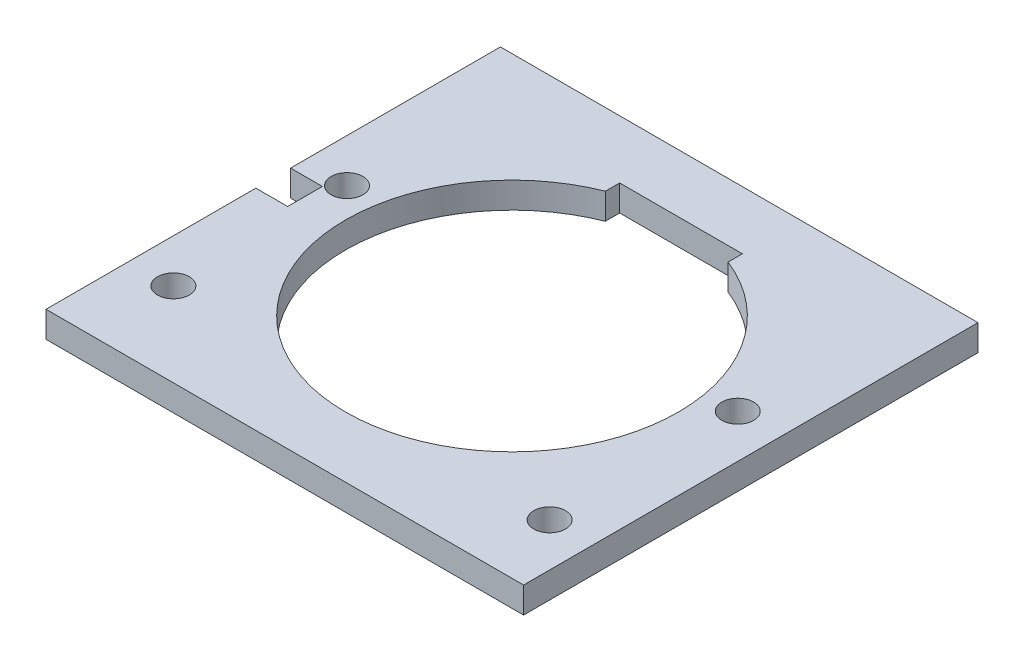
ISO-10303-21;
HEADER;
FILE_DESCRIPTION(('STEP AP214'),'2;1');
FILE_NAME('part.step','',(''),(''),'','','');
FILE_SCHEMA(('AUTOMOTIVE_DESIGN { 1 0 10303 214 1 1 1 1 }'));
ENDSEC;
DATA;
#1=APPLICATION_CONTEXT('core data for automotive mechanical design processes');
#2=APPLICATION_PROTOCOL_DEFINITION('international standard','automotive_design',2000,#1);
#3=PRODUCT_CONTEXT('',#1,'mechanical');
#4=PRODUCT('Part','Part','',(#3));
#5=PRODUCT_RELATED_PRODUCT_CATEGORY('part','',(#4));
#6=PRODUCT_DEFINITION_FORMATION('','',#4);
#7=PRODUCT_DEFINITION_CONTEXT('part definition',#1,'design');
#8=PRODUCT_DEFINITION('design','',#6,#7);
#9=PRODUCT_DEFINITION_SHAPE('','',#8);
#10=(LENGTH_UNIT() NAMED_UNIT(*) SI_UNIT(.MILLI.,.METRE.));
#11=(NAMED_UNIT(*) PLANE_ANGLE_UNIT() SI_UNIT($,.RADIAN.));
#12=(NAMED_UNIT(*) SI_UNIT($,.STERADIAN.) SOLID_ANGLE_UNIT());
#13=UNCERTAINTY_MEASURE_WITH_UNIT(LENGTH_MEASURE(1.E-05),#10,'distance_accuracy_value','');
#14=(GEOMETRIC_REPRESENTATION_CONTEXT(3) GLOBAL_UNCERTAINTY_ASSIGNED_CONTEXT((#13)) GLOBAL_UNIT_ASSIGNED_CONTEXT((#10,
#11,#12)) REPRESENTATION_CONTEXT('',''));
#15=CARTESIAN_POINT('',(0.,0.,0.));
#16=DIRECTION('',(0.,0.,1.));
#17=DIRECTION('',(1.,0.,0.));
#18=AXIS2_PLACEMENT_3D('',#15,#16,#17);
#19=CARTESIAN_POINT('',(-41.91,2.286,0.));
#20=DIRECTION('',(1.,0.,0.));
#21=DIRECTION('',(0.,0.,-1.));
#22=AXIS2_PLACEMENT_3D('',#19,#20,#21);
#23=PLANE('',#22);
#24=DIRECTION('',(0.,0.,1.));
#25=VECTOR('',#24,1.);
#26=CARTESIAN_POINT('',(-41.91,2.286,0.));
#27=LINE('',#26,#25);
#28=CARTESIAN_POINT('',(-41.91,2.286,21.463));
#29=VERTEX_POINT('',#28);
#30=CARTESIAN_POINT('',(-41.91,2.286,39.878));
#31=VERTEX_POINT('',#30);
#32=EDGE_CURVE('E190',#29,#31,#27,.T.);
#33=ORIENTED_EDGE('',*,*,#32,.F.);
#34=DIRECTION('',(0.,-1.,0.));
#35=VECTOR('',#34,1.);
#36=CARTESIAN_POINT('',(-41.91,2.286,21.463));
#37=LINE('',#36,#35);
#38=CARTESIAN_POINT('',(-41.91,0.,21.463));
#39=VERTEX_POINT('',#38);
#40=EDGE_CURVE('E147',#29,#39,#37,.T.);
#41=ORIENTED_EDGE('',*,*,#40,.T.);
#42=DIRECTION('',(0.,0.,1.));
#43=VECTOR('',#42,1.);
#44=CARTESIAN_POINT('',(-41.91,0.,0.));
#45=LINE('',#44,#43);
#46=CARTESIAN_POINT('',(-41.91,0.,39.878));
#47=VERTEX_POINT('',#46);
#48=EDGE_CURVE('E201',#39,#47,#45,.T.);
#49=ORIENTED_EDGE('',*,*,#48,.T.);
#50=DIRECTION('',(0.,-1.,0.));
#51=VECTOR('',#50,1.);
#52=CARTESIAN_POINT('',(-41.91,2.286,39.878));
#53=LINE('',#52,#51);
#54=EDGE_CURVE('E208',#31,#47,#53,.T.);
#55=ORIENTED_EDGE('',*,*,#54,.F.);
#56=EDGE_LOOP('',(#33,#41,#49,#55));
#57=FACE_BOUND('',#56,.T.);
#58=ADVANCED_FACE('F31',(#57),#23,.F.);
#59=CARTESIAN_POINT('',(0.,2.286,0.));
#60=DIRECTION('',(0.,1.,0.));
#61=DIRECTION('',(0.,0.,1.));
#62=AXIS2_PLACEMENT_3D('',#59,#60,#61);
#63=PLANE('',#62);
#64=CARTESIAN_POINT('',(-20.955,2.286,19.939));
#65=DIRECTION('',(0.,-1.,0.));
#66=DIRECTION('',(0.,0.,-1.));
#67=AXIS2_PLACEMENT_3D('',#64,#65,#66);
#68=CIRCLE('',#67,14.605);
#69=CARTESIAN_POINT('',(-15.5702,2.286,6.36291978662471));
#70=VERTEX_POINT('',#69);
#71=CARTESIAN_POINT('',(-26.3398,2.286,6.36291978662472));
#72=VERTEX_POINT('',#71);
#73=EDGE_CURVE('E120',#70,#72,#68,.T.);
#74=ORIENTED_EDGE('',*,*,#73,.T.);
#75=DIRECTION('',(0.,0.,1.));
#76=VECTOR('',#75,1.);
#77=CARTESIAN_POINT('',(-26.3398,2.286,25.273));
#78=LINE('',#77,#76);
#79=CARTESIAN_POINT('',(-26.3398,2.286,5.10540000000001));
#80=VERTEX_POINT('',#79);
#81=EDGE_CURVE('E140',#80,#72,#78,.T.);
#82=ORIENTED_EDGE('',*,*,#81,.F.);
#83=DIRECTION('',(-1.,0.,0.));
#84=VECTOR('',#83,1.);
#85=CARTESIAN_POINT('',(-26.3398,2.286,5.10540000000001));
#86=LINE('',#85,#84);
#87=CARTESIAN_POINT('',(-15.5702,2.286,5.10540000000001));
#88=VERTEX_POINT('',#87);
#89=EDGE_CURVE('E144',#88,#80,#86,.T.);
#90=ORIENTED_EDGE('',*,*,#89,.F.);
#91=DIRECTION('',(0.,0.,-1.));
#92=VECTOR('',#91,1.);
#93=CARTESIAN_POINT('',(-15.5702,2.286,25.273));
#94=LINE('',#93,#92);
#95=EDGE_CURVE('E151',#70,#88,#94,.T.);
#96=ORIENTED_EDGE('',*,*,#95,.F.);
#97=EDGE_LOOP('',(#74,#82,#90,#96));
#98=FACE_BOUND('',#97,.T.);
#99=DIRECTION('',(-1.,0.,0.));
#100=VECTOR('',#99,1.);
#101=CARTESIAN_POINT('',(-41.91,2.286,21.463));
#102=LINE('',#101,#100);
#103=CARTESIAN_POINT('',(-39.116,2.286,21.463));
#104=VERTEX_POINT('',#103);
#105=EDGE_CURVE('E258',#104,#29,#102,.T.);
#106=ORIENTED_EDGE('',*,*,#105,.T.);
#107=ORIENTED_EDGE('',*,*,#32,.T.);
#108=DIRECTION('',(1.,0.,0.));
#109=VECTOR('',#108,1.);
#110=CARTESIAN_POINT('',(-41.91,2.286,39.878));
#111=LINE('',#110,#109);
#112=CARTESIAN_POINT('',(0.,2.286,39.878));
#113=VERTEX_POINT('',#112);
#114=EDGE_CURVE('E194',#31,#113,#111,.T.);
#115=ORIENTED_EDGE('',*,*,#114,.T.);
#116=DIRECTION('',(0.,0.,-1.));
#117=VECTOR('',#116,1.);
#118=CARTESIAN_POINT('',(0.,2.286,39.878));
#119=LINE('',#118,#117);
#120=CARTESIAN_POINT('',(0.,2.286,0.));
#121=VERTEX_POINT('',#120);
#122=EDGE_CURVE('E184',#113,#121,#119,.T.);
#123=ORIENTED_EDGE('',*,*,#122,.T.);
#124=DIRECTION('',(-1.,0.,0.));
#125=VECTOR('',#124,1.);
#126=CARTESIAN_POINT('',(0.,2.286,0.));
#127=LINE('',#126,#125);
#128=CARTESIAN_POINT('',(-41.91,2.286,0.));
#129=VERTEX_POINT('',#128);
#130=EDGE_CURVE('E187',#121,#129,#127,.T.);
#131=ORIENTED_EDGE('',*,*,#130,.T.);
#132=CARTESIAN_POINT('',(-41.91,2.286,18.415));
#133=VERTEX_POINT('',#132);
#134=EDGE_CURVE('E191',#129,#133,#27,.T.);
#135=ORIENTED_EDGE('',*,*,#134,.T.);
#136=DIRECTION('',(1.,0.,0.));
#137=VECTOR('',#136,1.);
#138=CARTESIAN_POINT('',(-41.91,2.286,18.415));
#139=LINE('',#138,#137);
#140=CARTESIAN_POINT('',(-39.116,2.286,18.415));
#141=VERTEX_POINT('',#140);
#142=EDGE_CURVE('E53',#133,#141,#139,.T.);
#143=ORIENTED_EDGE('',*,*,#142,.T.);
#144=DIRECTION('',(0.,0.,1.));
#145=VECTOR('',#144,1.);
#146=CARTESIAN_POINT('',(-39.116,2.286,18.415));
#147=LINE('',#146,#145);
#148=EDGE_CURVE('E254',#141,#104,#147,.T.);
#149=ORIENTED_EDGE('',*,*,#148,.T.);
#150=EDGE_LOOP('',(#106,#107,#115,#123,#131,#135,#143,#149));
#151=FACE_BOUND('',#150,.T.);
#152=CARTESIAN_POINT('',(-3.81000000000001,2.286,33.782));
#153=DIRECTION('',(0.,1.,0.));
#154=DIRECTION('',(0.,0.,-1.));
#155=AXIS2_PLACEMENT_3D('',#152,#153,#154);
#156=CIRCLE('',#155,1.39700000000001);
#157=CARTESIAN_POINT('',(-3.81000000000001,2.286,32.385));
#158=VERTEX_POINT('',#157);
#159=EDGE_CURVE('E166',#158,#158,#156,.T.);
#160=ORIENTED_EDGE('',*,*,#159,.F.);
#161=EDGE_LOOP('',(#160));
#162=FACE_BOUND('',#161,.T.);
#163=CARTESIAN_POINT('',(-38.1,2.286,17.272));
#164=DIRECTION('',(0.,1.,0.));
#165=DIRECTION('',(0.,0.,1.));
#166=AXIS2_PLACEMENT_3D('',#163,#164,#165);
#167=CIRCLE('',#166,1.39700000000001);
#168=CARTESIAN_POINT('',(-38.1,2.286,18.669));
#169=VERTEX_POINT('',#168);
#170=EDGE_CURVE('E178',#169,#169,#167,.T.);
#171=ORIENTED_EDGE('',*,*,#170,.F.);
#172=EDGE_LOOP('',(#171));
#173=FACE_BOUND('',#172,.T.);
#174=CARTESIAN_POINT('',(-38.1,2.286,32.512));
#175=DIRECTION('',(0.,1.,0.));
#176=DIRECTION('',(0.,0.,1.));
#177=AXIS2_PLACEMENT_3D('',#174,#175,#176);
#178=CIRCLE('',#177,1.39700000000001);
#179=CARTESIAN_POINT('',(-38.1,2.286,33.909));
#180=VERTEX_POINT('',#179);
#181=EDGE_CURVE('E172',#180,#180,#178,.T.);
#182=ORIENTED_EDGE('',*,*,#181,.F.);
#183=EDGE_LOOP('',(#182));
#184=FACE_BOUND('',#183,.T.);
#185=CARTESIAN_POINT('',(-3.81000000000001,2.286,17.272));
#186=DIRECTION('',(0.,1.,0.));
#187=DIRECTION('',(0.,0.,-1.));
#188=AXIS2_PLACEMENT_3D('',#185,#186,#187);
#189=CIRCLE('',#188,1.39700000000001);
#190=CARTESIAN_POINT('',(-3.81000000000001,2.286,15.875));
#191=VERTEX_POINT('',#190);
#192=EDGE_CURVE('E160',#191,#191,#189,.T.);
#193=ORIENTED_EDGE('',*,*,#192,.F.);
#194=EDGE_LOOP('',(#193));
#195=FACE_BOUND('',#194,.T.);
#196=ADVANCED_FACE('F237',(#98,#151,#162,#173,#184,#195),#63,.T.);
#197=CARTESIAN_POINT('',(0.,0.,0.));
#198=DIRECTION('',(0.,1.,0.));
#199=DIRECTION('',(0.,0.,1.));
#200=AXIS2_PLACEMENT_3D('',#197,#198,#199);
#201=PLANE('',#200);
#202=DIRECTION('',(0.,0.,1.));
#203=VECTOR('',#202,1.);
#204=CARTESIAN_POINT('',(-26.3398,0.,25.273));
#205=LINE('',#204,#203);
#206=CARTESIAN_POINT('',(-26.3398,0.,5.10540000000001));
#207=VERTEX_POINT('',#206);
#208=CARTESIAN_POINT('',(-26.3398,0.,6.36291978662472));
#209=VERTEX_POINT('',#208);
#210=EDGE_CURVE('E133',#207,#209,#205,.T.);
#211=ORIENTED_EDGE('',*,*,#210,.T.);
#212=CARTESIAN_POINT('',(-20.955,0.,19.939));
#213=DIRECTION('',(0.,-1.,0.));
#214=DIRECTION('',(0.,0.,-1.));
#215=AXIS2_PLACEMENT_3D('',#212,#213,#214);
#216=CIRCLE('',#215,14.605);
#217=CARTESIAN_POINT('',(-15.5702,0.,6.36291978662471));
#218=VERTEX_POINT('',#217);
#219=EDGE_CURVE('E46',#218,#209,#216,.T.);
#220=ORIENTED_EDGE('',*,*,#219,.F.);
#221=DIRECTION('',(0.,0.,-1.));
#222=VECTOR('',#221,1.);
#223=CARTESIAN_POINT('',(-15.5702,0.,25.273));
#224=LINE('',#223,#222);
#225=CARTESIAN_POINT('',(-15.5702,0.,5.10540000000001));
#226=VERTEX_POINT('',#225);
#227=EDGE_CURVE('E131',#218,#226,#224,.T.);
#228=ORIENTED_EDGE('',*,*,#227,.T.);
#229=DIRECTION('',(-1.,0.,0.));
#230=VECTOR('',#229,1.);
#231=CARTESIAN_POINT('',(-26.3398,0.,5.10540000000001));
#232=LINE('',#231,#230);
#233=EDGE_CURVE('E139',#226,#207,#232,.T.);
#234=ORIENTED_EDGE('',*,*,#233,.T.);
#235=EDGE_LOOP('',(#211,#220,#228,#234));
#236=FACE_BOUND('',#235,.T.);
#237=CARTESIAN_POINT('',(-3.81000000000001,0.,33.782));
#238=DIRECTION('',(0.,1.,0.));
#239=DIRECTION('',(0.,0.,-1.));
#240=AXIS2_PLACEMENT_3D('',#237,#238,#239);
#241=CIRCLE('',#240,1.39700000000001);
#242=CARTESIAN_POINT('',(-3.81000000000001,0.,32.385));
#243=VERTEX_POINT('',#242);
#244=EDGE_CURVE('E163',#243,#243,#241,.T.);
#245=ORIENTED_EDGE('',*,*,#244,.T.);
#246=EDGE_LOOP('',(#245));
#247=FACE_BOUND('',#246,.T.);
#248=CARTESIAN_POINT('',(-38.1,0.,17.272));
#249=DIRECTION('',(0.,1.,0.));
#250=DIRECTION('',(0.,0.,1.));
#251=AXIS2_PLACEMENT_3D('',#248,#249,#250);
#252=CIRCLE('',#251,1.39700000000001);
#253=CARTESIAN_POINT('',(-38.1,0.,18.669));
#254=VERTEX_POINT('',#253);
#255=EDGE_CURVE('E175',#254,#254,#252,.T.);
#256=ORIENTED_EDGE('',*,*,#255,.T.);
#257=EDGE_LOOP('',(#256));
#258=FACE_BOUND('',#257,.T.);
#259=ORIENTED_EDGE('',*,*,#48,.F.);
#260=DIRECTION('',(-1.,0.,0.));
#261=VECTOR('',#260,1.);
#262=CARTESIAN_POINT('',(-41.91,0.,21.463));
#263=LINE('',#262,#261);
#264=CARTESIAN_POINT('',(-39.116,0.,21.463));
#265=VERTEX_POINT('',#264);
#266=EDGE_CURVE('E124',#265,#39,#263,.T.);
#267=ORIENTED_EDGE('',*,*,#266,.F.);
#268=DIRECTION('',(0.,0.,1.));
#269=VECTOR('',#268,1.);
#270=CARTESIAN_POINT('',(-39.116,0.,18.415));
#271=LINE('',#270,#269);
#272=CARTESIAN_POINT('',(-39.116,0.,18.415));
#273=VERTEX_POINT('',#272);
#274=EDGE_CURVE('E249',#273,#265,#271,.T.);
#275=ORIENTED_EDGE('',*,*,#274,.F.);
#276=DIRECTION('',(1.,0.,0.));
#277=VECTOR('',#276,1.);
#278=CARTESIAN_POINT('',(-41.91,0.,18.415));
#279=LINE('',#278,#277);
#280=CARTESIAN_POINT('',(-41.91,0.,18.415));
#281=VERTEX_POINT('',#280);
#282=EDGE_CURVE('E230',#281,#273,#279,.T.);
#283=ORIENTED_EDGE('',*,*,#282,.F.);
#284=CARTESIAN_POINT('',(-41.91,0.,0.));
#285=VERTEX_POINT('',#284);
#286=EDGE_CURVE('E202',#285,#281,#45,.T.);
#287=ORIENTED_EDGE('',*,*,#286,.F.);
#288=DIRECTION('',(-1.,0.,0.));
#289=VECTOR('',#288,1.);
#290=CARTESIAN_POINT('',(0.,0.,0.));
#291=LINE('',#290,#289);
#292=CARTESIAN_POINT('',(0.,0.,0.));
#293=VERTEX_POINT('',#292);
#294=EDGE_CURVE('E199',#293,#285,#291,.T.);
#295=ORIENTED_EDGE('',*,*,#294,.F.);
#296=DIRECTION('',(0.,0.,-1.));
#297=VECTOR('',#296,1.);
#298=CARTESIAN_POINT('',(0.,0.,39.878));
#299=LINE('',#298,#297);
#300=CARTESIAN_POINT('',(0.,0.,39.878));
#301=VERTEX_POINT('',#300);
#302=EDGE_CURVE('E181',#301,#293,#299,.T.);
#303=ORIENTED_EDGE('',*,*,#302,.F.);
#304=DIRECTION('',(1.,0.,0.));
#305=VECTOR('',#304,1.);
#306=CARTESIAN_POINT('',(-41.91,0.,39.878));
#307=LINE('',#306,#305);
#308=EDGE_CURVE('E188',#47,#301,#307,.T.);
#309=ORIENTED_EDGE('',*,*,#308,.F.);
#310=EDGE_LOOP('',(#259,#267,#275,#283,#287,#295,#303,#309));
#311=FACE_BOUND('',#310,.T.);
#312=CARTESIAN_POINT('',(-38.1,0.,32.512));
#313=DIRECTION('',(0.,1.,0.));
#314=DIRECTION('',(0.,0.,1.));
#315=AXIS2_PLACEMENT_3D('',#312,#313,#314);
#316=CIRCLE('',#315,1.39700000000001);
#317=CARTESIAN_POINT('',(-38.1,0.,33.909));
#318=VERTEX_POINT('',#317);
#319=EDGE_CURVE('E169',#318,#318,#316,.T.);
#320=ORIENTED_EDGE('',*,*,#319,.T.);
#321=EDGE_LOOP('',(#320));
#322=FACE_BOUND('',#321,.T.);
#323=CARTESIAN_POINT('',(-3.81000000000001,0.,17.272));
#324=DIRECTION('',(0.,1.,0.));
#325=DIRECTION('',(0.,0.,-1.));
#326=AXIS2_PLACEMENT_3D('',#323,#324,#325);
#327=CIRCLE('',#326,1.39700000000001);
#328=CARTESIAN_POINT('',(-3.81000000000001,0.,15.875));
#329=VERTEX_POINT('',#328);
#330=EDGE_CURVE('E158',#329,#329,#327,.T.);
#331=ORIENTED_EDGE('',*,*,#330,.T.);
#332=EDGE_LOOP('',(#331));
#333=FACE_BOUND('',#332,.T.);
#334=ADVANCED_FACE('F128',(#236,#247,#258,#311,#322,#333),#201,.F.);
#335=CARTESIAN_POINT('',(0.,2.286,39.878));
#336=DIRECTION('',(-1.,0.,0.));
#337=DIRECTION('',(0.,0.,1.));
#338=AXIS2_PLACEMENT_3D('',#335,#336,#337);
#339=PLANE('',#338);
#340=ORIENTED_EDGE('',*,*,#302,.T.);
#341=DIRECTION('',(0.,-1.,0.));
#342=VECTOR('',#341,1.);
#343=CARTESIAN_POINT('',(0.,2.286,0.));
#344=LINE('',#343,#342);
#345=EDGE_CURVE('E39',#121,#293,#344,.T.);
#346=ORIENTED_EDGE('',*,*,#345,.F.);
#347=ORIENTED_EDGE('',*,*,#122,.F.);
#348=DIRECTION('',(0.,-1.,0.));
#349=VECTOR('',#348,1.);
#350=CARTESIAN_POINT('',(0.,2.286,39.878));
#351=LINE('',#350,#349);
#352=EDGE_CURVE('E196',#113,#301,#351,.T.);
#353=ORIENTED_EDGE('',*,*,#352,.T.);
#354=EDGE_LOOP('',(#340,#346,#347,#353));
#355=FACE_BOUND('',#354,.T.);
#356=ADVANCED_FACE('F33',(#355),#339,.F.);
#357=CARTESIAN_POINT('',(0.,2.286,0.));
#358=DIRECTION('',(0.,0.,1.));
#359=DIRECTION('',(1.,0.,0.));
#360=AXIS2_PLACEMENT_3D('',#357,#358,#359);
#361=PLANE('',#360);
#362=ORIENTED_EDGE('',*,*,#294,.T.);
#363=DIRECTION('',(0.,-1.,0.));
#364=VECTOR('',#363,1.);
#365=CARTESIAN_POINT('',(-41.91,2.286,0.));
#366=LINE('',#365,#364);
#367=EDGE_CURVE('E211',#129,#285,#366,.T.);
#368=ORIENTED_EDGE('',*,*,#367,.F.);
#369=ORIENTED_EDGE('',*,*,#130,.F.);
#370=ORIENTED_EDGE('',*,*,#345,.T.);
#371=EDGE_LOOP('',(#362,#368,#369,#370));
#372=FACE_BOUND('',#371,.T.);
#373=ADVANCED_FACE('F216',(#372),#361,.F.);
#374=ORIENTED_EDGE('',*,*,#286,.T.);
#375=DIRECTION('',(0.,-1.,0.));
#376=VECTOR('',#375,1.);
#377=CARTESIAN_POINT('',(-41.91,2.286,18.415));
#378=LINE('',#377,#376);
#379=EDGE_CURVE('E234',#133,#281,#378,.T.);
#380=ORIENTED_EDGE('',*,*,#379,.F.);
#381=ORIENTED_EDGE('',*,*,#134,.F.);
#382=ORIENTED_EDGE('',*,*,#367,.T.);
#383=EDGE_LOOP('',(#374,#380,#381,#382));
#384=FACE_BOUND('',#383,.T.);
#385=ADVANCED_FACE('F232',(#384),#23,.F.);
#386=CARTESIAN_POINT('',(-41.91,2.286,39.878));
#387=DIRECTION('',(0.,0.,-1.));
#388=DIRECTION('',(-1.,0.,0.));
#389=AXIS2_PLACEMENT_3D('',#386,#387,#388);
#390=PLANE('',#389);
#391=ORIENTED_EDGE('',*,*,#308,.T.);
#392=ORIENTED_EDGE('',*,*,#352,.F.);
#393=ORIENTED_EDGE('',*,*,#114,.F.);
#394=ORIENTED_EDGE('',*,*,#54,.T.);
#395=EDGE_LOOP('',(#391,#392,#393,#394));
#396=FACE_BOUND('',#395,.T.);
#397=ADVANCED_FACE('F244',(#396),#390,.F.);
#398=CARTESIAN_POINT('',(-38.1,2.286,17.272));
#399=DIRECTION('',(0.,-1.,0.));
#400=DIRECTION('',(0.,0.,-1.));
#401=AXIS2_PLACEMENT_3D('',#398,#399,#400);
#402=CYLINDRICAL_SURFACE('',#401,1.39700000000001);
#403=ORIENTED_EDGE('',*,*,#170,.T.);
#404=EDGE_LOOP('',(#403));
#405=FACE_BOUND('',#404,.T.);
#406=ORIENTED_EDGE('',*,*,#255,.F.);
#407=EDGE_LOOP('',(#406));
#408=FACE_BOUND('',#407,.T.);
#409=ADVANCED_FACE('F295',(#405,#408),#402,.F.);
#410=CARTESIAN_POINT('',(-38.1,2.286,32.512));
#411=DIRECTION('',(0.,-1.,0.));
#412=DIRECTION('',(0.,0.,-1.));
#413=AXIS2_PLACEMENT_3D('',#410,#411,#412);
#414=CYLINDRICAL_SURFACE('',#413,1.39700000000001);
#415=ORIENTED_EDGE('',*,*,#181,.T.);
#416=EDGE_LOOP('',(#415));
#417=FACE_BOUND('',#416,.T.);
#418=ORIENTED_EDGE('',*,*,#319,.F.);
#419=EDGE_LOOP('',(#418));
#420=FACE_BOUND('',#419,.T.);
#421=ADVANCED_FACE('F308',(#417,#420),#414,.F.);
#422=CARTESIAN_POINT('',(-3.81000000000001,2.286,33.782));
#423=DIRECTION('',(0.,-1.,0.));
#424=DIRECTION('',(0.,0.,-1.));
#425=AXIS2_PLACEMENT_3D('',#422,#423,#424);
#426=CYLINDRICAL_SURFACE('',#425,1.39700000000001);
#427=ORIENTED_EDGE('',*,*,#159,.T.);
#428=EDGE_LOOP('',(#427));
#429=FACE_BOUND('',#428,.T.);
#430=ORIENTED_EDGE('',*,*,#244,.F.);
#431=EDGE_LOOP('',(#430));
#432=FACE_BOUND('',#431,.T.);
#433=ADVANCED_FACE('F312',(#429,#432),#426,.F.);
#434=CARTESIAN_POINT('',(-3.81000000000001,2.286,17.272));
#435=DIRECTION('',(0.,-1.,0.));
#436=DIRECTION('',(0.,0.,-1.));
#437=AXIS2_PLACEMENT_3D('',#434,#435,#436);
#438=CYLINDRICAL_SURFACE('',#437,1.39700000000001);
#439=ORIENTED_EDGE('',*,*,#192,.T.);
#440=EDGE_LOOP('',(#439));
#441=FACE_BOUND('',#440,.T.);
#442=ORIENTED_EDGE('',*,*,#330,.F.);
#443=EDGE_LOOP('',(#442));
#444=FACE_BOUND('',#443,.T.);
#445=ADVANCED_FACE('F316',(#441,#444),#438,.F.);
#446=CARTESIAN_POINT('',(-15.5702,0.,25.273));
#447=DIRECTION('',(1.,0.,0.));
#448=DIRECTION('',(0.,0.,-1.));
#449=AXIS2_PLACEMENT_3D('',#446,#447,#448);
#450=PLANE('',#449);
#451=ORIENTED_EDGE('',*,*,#227,.F.);
#452=DIRECTION('',(0.,-1.,0.));
#453=VECTOR('',#452,1.);
#454=CARTESIAN_POINT('',(-15.5702,2.286,6.36291978662471));
#455=LINE('',#454,#453);
#456=EDGE_CURVE('E117',#218,#70,#455,.F.);
#457=ORIENTED_EDGE('',*,*,#456,.T.);
#458=ORIENTED_EDGE('',*,*,#95,.T.);
#459=DIRECTION('',(0.,1.,0.));
#460=VECTOR('',#459,1.);
#461=CARTESIAN_POINT('',(-15.5702,0.,5.10540000000001));
#462=LINE('',#461,#460);
#463=EDGE_CURVE('E137',#226,#88,#462,.T.);
#464=ORIENTED_EDGE('',*,*,#463,.F.);
#465=EDGE_LOOP('',(#451,#457,#458,#464));
#466=FACE_BOUND('',#465,.T.);
#467=ADVANCED_FACE('F135',(#466),#450,.F.);
#468=CARTESIAN_POINT('',(-26.3398,0.,25.273));
#469=DIRECTION('',(-1.,0.,0.));
#470=DIRECTION('',(0.,0.,1.));
#471=AXIS2_PLACEMENT_3D('',#468,#469,#470);
#472=PLANE('',#471);
#473=ORIENTED_EDGE('',*,*,#81,.T.);
#474=DIRECTION('',(0.,-1.,0.));
#475=VECTOR('',#474,1.);
#476=CARTESIAN_POINT('',(-26.3398,2.286,6.36291978662472));
#477=LINE('',#476,#475);
#478=EDGE_CURVE('E11',#72,#209,#477,.T.);
#479=ORIENTED_EDGE('',*,*,#478,.T.);
#480=ORIENTED_EDGE('',*,*,#210,.F.);
#481=DIRECTION('',(0.,1.,0.));
#482=VECTOR('',#481,1.);
#483=CARTESIAN_POINT('',(-26.3398,0.,5.10540000000001));
#484=LINE('',#483,#482);
#485=EDGE_CURVE('E156',#207,#80,#484,.T.);
#486=ORIENTED_EDGE('',*,*,#485,.T.);
#487=EDGE_LOOP('',(#473,#479,#480,#486));
#488=FACE_BOUND('',#487,.T.);
#489=ADVANCED_FACE('F268',(#488),#472,.F.);
#490=CARTESIAN_POINT('',(-26.3398,0.,5.10540000000001));
#491=DIRECTION('',(0.,0.,-1.));
#492=DIRECTION('',(-1.,0.,0.));
#493=AXIS2_PLACEMENT_3D('',#490,#491,#492);
#494=PLANE('',#493);
#495=ORIENTED_EDGE('',*,*,#89,.T.);
#496=ORIENTED_EDGE('',*,*,#485,.F.);
#497=ORIENTED_EDGE('',*,*,#233,.F.);
#498=ORIENTED_EDGE('',*,*,#463,.T.);
#499=EDGE_LOOP('',(#495,#496,#497,#498));
#500=FACE_BOUND('',#499,.T.);
#501=ADVANCED_FACE('F271',(#500),#494,.F.);
#502=CARTESIAN_POINT('',(-41.91,2.286,21.463));
#503=DIRECTION('',(0.,0.,1.));
#504=DIRECTION('',(1.,0.,0.));
#505=AXIS2_PLACEMENT_3D('',#502,#503,#504);
#506=PLANE('',#505);
#507=ORIENTED_EDGE('',*,*,#266,.T.);
#508=ORIENTED_EDGE('',*,*,#40,.F.);
#509=ORIENTED_EDGE('',*,*,#105,.F.);
#510=DIRECTION('',(0.,-1.,0.));
#511=VECTOR('',#510,1.);
#512=CARTESIAN_POINT('',(-39.116,2.286,21.463));
#513=LINE('',#512,#511);
#514=EDGE_CURVE('E153',#104,#265,#513,.T.);
#515=ORIENTED_EDGE('',*,*,#514,.T.);
#516=EDGE_LOOP('',(#507,#508,#509,#515));
#517=FACE_BOUND('',#516,.T.);
#518=ADVANCED_FACE('F273',(#517),#506,.F.);
#519=CARTESIAN_POINT('',(-39.116,2.286,18.415));
#520=DIRECTION('',(1.,0.,0.));
#521=DIRECTION('',(0.,0.,-1.));
#522=AXIS2_PLACEMENT_3D('',#519,#520,#521);
#523=PLANE('',#522);
#524=ORIENTED_EDGE('',*,*,#274,.T.);
#525=ORIENTED_EDGE('',*,*,#514,.F.);
#526=ORIENTED_EDGE('',*,*,#148,.F.);
#527=DIRECTION('',(0.,-1.,0.));
#528=VECTOR('',#527,1.);
#529=CARTESIAN_POINT('',(-39.116,2.286,18.415));
#530=LINE('',#529,#528);
#531=EDGE_CURVE('E260',#141,#273,#530,.T.);
#532=ORIENTED_EDGE('',*,*,#531,.T.);
#533=EDGE_LOOP('',(#524,#525,#526,#532));
#534=FACE_BOUND('',#533,.T.);
#535=ADVANCED_FACE('F279',(#534),#523,.F.);
#536=CARTESIAN_POINT('',(-41.91,2.286,18.415));
#537=DIRECTION('',(0.,0.,-1.));
#538=DIRECTION('',(-1.,0.,0.));
#539=AXIS2_PLACEMENT_3D('',#536,#537,#538);
#540=PLANE('',#539);
#541=ORIENTED_EDGE('',*,*,#282,.T.);
#542=ORIENTED_EDGE('',*,*,#531,.F.);
#543=ORIENTED_EDGE('',*,*,#142,.F.);
#544=ORIENTED_EDGE('',*,*,#379,.T.);
#545=EDGE_LOOP('',(#541,#542,#543,#544));
#546=FACE_BOUND('',#545,.T.);
#547=ADVANCED_FACE('F346',(#546),#540,.F.);
#548=CARTESIAN_POINT('',(-20.955,2.286,19.939));
#549=DIRECTION('',(0.,-1.,0.));
#550=DIRECTION('',(0.,0.,-1.));
#551=AXIS2_PLACEMENT_3D('',#548,#549,#550);
#552=CYLINDRICAL_SURFACE('',#551,14.605);
#553=ORIENTED_EDGE('',*,*,#219,.T.);
#554=ORIENTED_EDGE('',*,*,#478,.F.);
#555=ORIENTED_EDGE('',*,*,#73,.F.);
#556=ORIENTED_EDGE('',*,*,#456,.F.);
#557=EDGE_LOOP('',(#553,#554,#555,#556));
#558=FACE_BOUND('',#557,.T.);
#559=ADVANCED_FACE('F118',(#558),#552,.F.);
#560=CLOSED_SHELL('',(#58,#196,#334,#356,#373,#385,#397,#409,#421,#433,#445,#467,#489,#501,#518,
#535,#547,#559));
#561=MANIFOLD_SOLID_BREP('B2',#560);
#562=ADVANCED_BREP_SHAPE_REPRESENTATION('',(#18,#561),#14);
#563=SHAPE_DEFINITION_REPRESENTATION(#9,#562);
ENDSEC;
END-ISO-10303-21;
